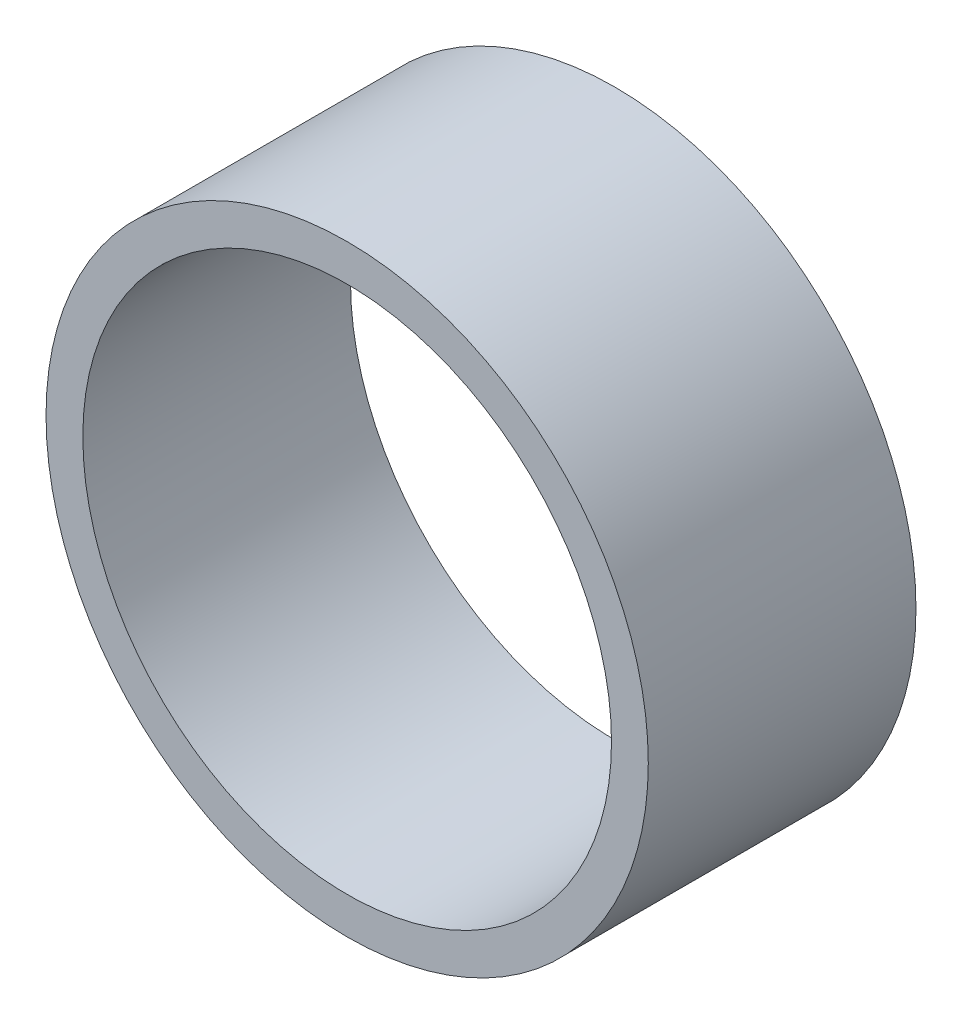
ISO-10303-21;
HEADER;
FILE_DESCRIPTION(('STEP AP214'),'2;1');
FILE_NAME('part.step','',(''),(''),'','','');
FILE_SCHEMA(('AUTOMOTIVE_DESIGN { 1 0 10303 214 1 1 1 1 }'));
ENDSEC;
DATA;
#1=APPLICATION_CONTEXT('core data for automotive mechanical design processes');
#2=APPLICATION_PROTOCOL_DEFINITION('international standard','automotive_design',2000,#1);
#3=PRODUCT_CONTEXT('',#1,'mechanical');
#4=PRODUCT('Part','Part','',(#3));
#5=PRODUCT_RELATED_PRODUCT_CATEGORY('part','',(#4));
#6=PRODUCT_DEFINITION_FORMATION('','',#4);
#7=PRODUCT_DEFINITION_CONTEXT('part definition',#1,'design');
#8=PRODUCT_DEFINITION('design','',#6,#7);
#9=PRODUCT_DEFINITION_SHAPE('','',#8);
#10=(LENGTH_UNIT() NAMED_UNIT(*) SI_UNIT(.MILLI.,.METRE.));
#11=(NAMED_UNIT(*) PLANE_ANGLE_UNIT() SI_UNIT($,.RADIAN.));
#12=(NAMED_UNIT(*) SI_UNIT($,.STERADIAN.) SOLID_ANGLE_UNIT());
#13=UNCERTAINTY_MEASURE_WITH_UNIT(LENGTH_MEASURE(1.E-05),#10,'distance_accuracy_value','');
#14=(GEOMETRIC_REPRESENTATION_CONTEXT(3) GLOBAL_UNCERTAINTY_ASSIGNED_CONTEXT((#13)) GLOBAL_UNIT_ASSIGNED_CONTEXT((#10,
#11,#12)) REPRESENTATION_CONTEXT('',''));
#15=CARTESIAN_POINT('',(0.,0.,0.));
#16=DIRECTION('',(0.,0.,1.));
#17=DIRECTION('',(1.,0.,0.));
#18=AXIS2_PLACEMENT_3D('',#15,#16,#17);
#19=CARTESIAN_POINT('',(0.,0.,25.4));
#20=DIRECTION('',(0.,0.,1.));
#21=DIRECTION('',(1.,0.,0.));
#22=AXIS2_PLACEMENT_3D('',#19,#20,#21);
#23=PLANE('',#22);
#24=CARTESIAN_POINT('',(0.,0.,25.4));
#25=DIRECTION('',(0.,0.,1.));
#26=DIRECTION('',(1.,0.,0.));
#27=AXIS2_PLACEMENT_3D('',#24,#25,#26);
#28=CIRCLE('',#27,28.575);
#29=CARTESIAN_POINT('',(28.575,0.,25.4));
#30=VERTEX_POINT('',#29);
#31=EDGE_CURVE('E10',#30,#30,#28,.T.);
#32=ORIENTED_EDGE('',*,*,#31,.T.);
#33=EDGE_LOOP('',(#32));
#34=FACE_BOUND('',#33,.T.);
#35=CARTESIAN_POINT('',(0.,0.,25.4));
#36=DIRECTION('',(0.,0.,1.));
#37=DIRECTION('',(1.,0.,0.));
#38=AXIS2_PLACEMENT_3D('',#35,#36,#37);
#39=CIRCLE('',#38,25.0825);
#40=CARTESIAN_POINT('',(25.0825,0.,25.4));
#41=VERTEX_POINT('',#40);
#42=EDGE_CURVE('E42',#41,#41,#39,.T.);
#43=ORIENTED_EDGE('',*,*,#42,.F.);
#44=EDGE_LOOP('',(#43));
#45=FACE_BOUND('',#44,.T.);
#46=ADVANCED_FACE('F31',(#34,#45),#23,.T.);
#47=CARTESIAN_POINT('',(0.,0.,0.));
#48=DIRECTION('',(0.,0.,1.));
#49=DIRECTION('',(1.,0.,0.));
#50=AXIS2_PLACEMENT_3D('',#47,#48,#49);
#51=PLANE('',#50);
#52=CARTESIAN_POINT('',(0.,0.,0.));
#53=DIRECTION('',(0.,0.,1.));
#54=DIRECTION('',(1.,0.,0.));
#55=AXIS2_PLACEMENT_3D('',#52,#53,#54);
#56=CIRCLE('',#55,28.575);
#57=CARTESIAN_POINT('',(28.575,0.,0.));
#58=VERTEX_POINT('',#57);
#59=EDGE_CURVE('E35',#58,#58,#56,.T.);
#60=ORIENTED_EDGE('',*,*,#59,.F.);
#61=EDGE_LOOP('',(#60));
#62=FACE_BOUND('',#61,.T.);
#63=CARTESIAN_POINT('',(0.,0.,0.));
#64=DIRECTION('',(0.,0.,1.));
#65=DIRECTION('',(1.,0.,0.));
#66=AXIS2_PLACEMENT_3D('',#63,#64,#65);
#67=CIRCLE('',#66,25.0825);
#68=CARTESIAN_POINT('',(25.0825,0.,0.));
#69=VERTEX_POINT('',#68);
#70=EDGE_CURVE('E44',#69,#69,#67,.T.);
#71=ORIENTED_EDGE('',*,*,#70,.T.);
#72=EDGE_LOOP('',(#71));
#73=FACE_BOUND('',#72,.T.);
#74=ADVANCED_FACE('F54',(#62,#73),#51,.F.);
#75=CARTESIAN_POINT('',(0.,0.,25.4));
#76=DIRECTION('',(0.,0.,-1.));
#77=DIRECTION('',(-1.,0.,0.));
#78=AXIS2_PLACEMENT_3D('',#75,#76,#77);
#79=CYLINDRICAL_SURFACE('',#78,28.575);
#80=ORIENTED_EDGE('',*,*,#31,.F.);
#81=EDGE_LOOP('',(#80));
#82=FACE_BOUND('',#81,.T.);
#83=ORIENTED_EDGE('',*,*,#59,.T.);
#84=EDGE_LOOP('',(#83));
#85=FACE_BOUND('',#84,.T.);
#86=ADVANCED_FACE('F33',(#82,#85),#79,.T.);
#87=CARTESIAN_POINT('',(0.,0.,25.4));
#88=DIRECTION('',(0.,0.,-1.));
#89=DIRECTION('',(-1.,0.,0.));
#90=AXIS2_PLACEMENT_3D('',#87,#88,#89);
#91=CYLINDRICAL_SURFACE('',#90,25.0825);
#92=ORIENTED_EDGE('',*,*,#42,.T.);
#93=EDGE_LOOP('',(#92));
#94=FACE_BOUND('',#93,.T.);
#95=ORIENTED_EDGE('',*,*,#70,.F.);
#96=EDGE_LOOP('',(#95));
#97=FACE_BOUND('',#96,.T.);
#98=ADVANCED_FACE('F50',(#94,#97),#91,.F.);
#99=CLOSED_SHELL('',(#46,#74,#86,#98));
#100=MANIFOLD_SOLID_BREP('B2',#99);
#101=ADVANCED_BREP_SHAPE_REPRESENTATION('',(#18,#100),#14);
#102=SHAPE_DEFINITION_REPRESENTATION(#9,#101);
ENDSEC;
END-ISO-10303-21;
